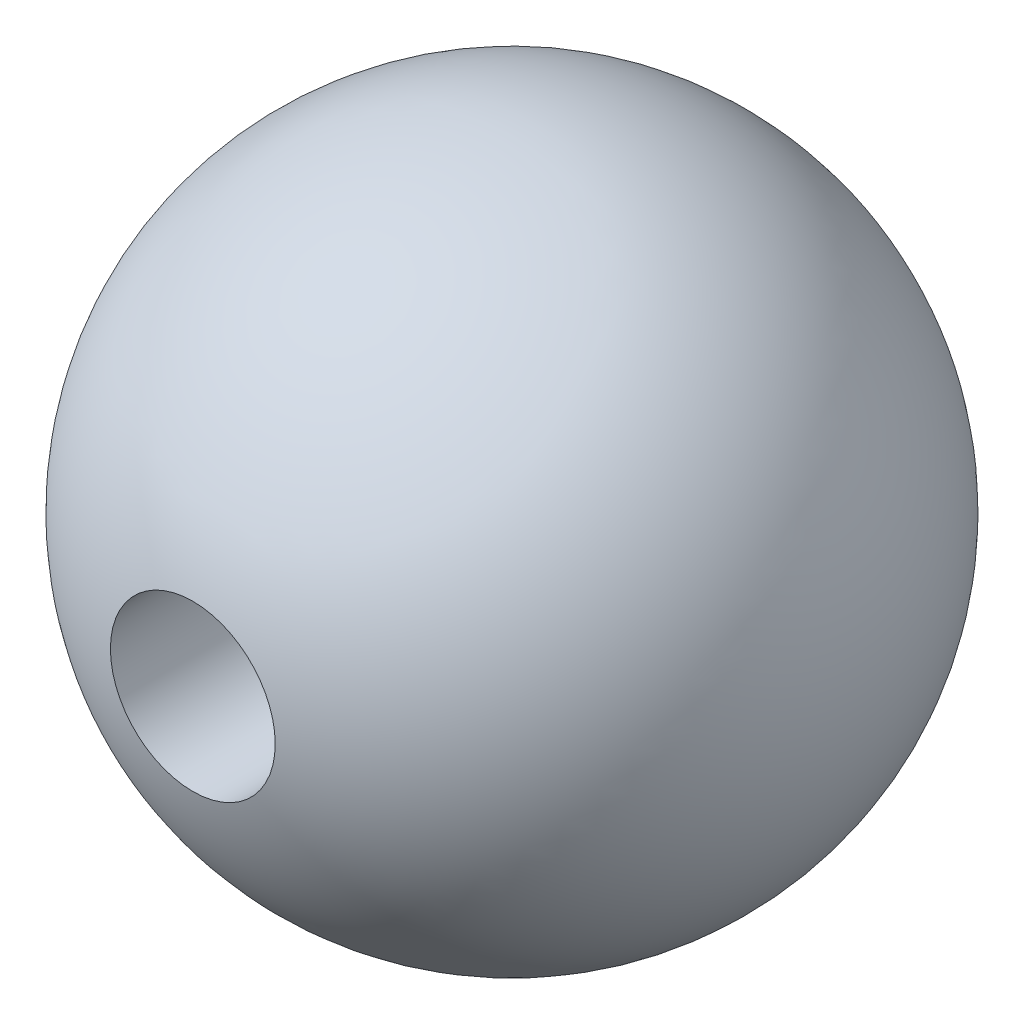
ISO-10303-21;
HEADER;
FILE_DESCRIPTION(('STEP AP214'),'2;1');
FILE_NAME('part.step','',(''),(''),'','','');
FILE_SCHEMA(('AUTOMOTIVE_DESIGN { 1 0 10303 214 1 1 1 1 }'));
ENDSEC;
DATA;
#1=APPLICATION_CONTEXT('core data for automotive mechanical design processes');
#2=APPLICATION_PROTOCOL_DEFINITION('international standard','automotive_design',2000,#1);
#3=PRODUCT_CONTEXT('',#1,'mechanical');
#4=PRODUCT('Part','Part','',(#3));
#5=PRODUCT_RELATED_PRODUCT_CATEGORY('part','',(#4));
#6=PRODUCT_DEFINITION_FORMATION('','',#4);
#7=PRODUCT_DEFINITION_CONTEXT('part definition',#1,'design');
#8=PRODUCT_DEFINITION('design','',#6,#7);
#9=PRODUCT_DEFINITION_SHAPE('','',#8);
#10=(LENGTH_UNIT() NAMED_UNIT(*) SI_UNIT(.MILLI.,.METRE.));
#11=(NAMED_UNIT(*) PLANE_ANGLE_UNIT() SI_UNIT($,.RADIAN.));
#12=(NAMED_UNIT(*) SI_UNIT($,.STERADIAN.) SOLID_ANGLE_UNIT());
#13=UNCERTAINTY_MEASURE_WITH_UNIT(LENGTH_MEASURE(1.E-05),#10,'distance_accuracy_value','');
#14=(GEOMETRIC_REPRESENTATION_CONTEXT(3) GLOBAL_UNCERTAINTY_ASSIGNED_CONTEXT((#13)) GLOBAL_UNIT_ASSIGNED_CONTEXT((#10,
#11,#12)) REPRESENTATION_CONTEXT('',''));
#15=CARTESIAN_POINT('',(0.,0.,0.));
#16=DIRECTION('',(0.,0.,1.));
#17=DIRECTION('',(1.,0.,0.));
#18=AXIS2_PLACEMENT_3D('',#15,#16,#17);
#19=CARTESIAN_POINT('',(0.,0.,0.201638937895726));
#20=DIRECTION('',(0.,0.,-1.));
#21=DIRECTION('',(0.,-1.,0.));
#22=AXIS2_PLACEMENT_3D('',#19,#20,#21);
#23=SPHERICAL_SURFACE('',#22,12.7);
#24=CARTESIAN_POINT('',(0.,0.,12.4983610621043));
#25=DIRECTION('',(0.,0.,-1.));
#26=DIRECTION('',(0.,1.,0.));
#27=AXIS2_PLACEMENT_3D('',#24,#25,#26);
#28=CIRCLE('',#27,3.175);
#29=CARTESIAN_POINT('',(0.,3.175,12.4983610621043));
#30=VERTEX_POINT('',#29);
#31=EDGE_CURVE('E44',#30,#30,#28,.T.);
#32=ORIENTED_EDGE('',*,*,#31,.T.);
#33=EDGE_LOOP('',(#32));
#34=FACE_BOUND('',#33,.T.);
#35=ADVANCED_FACE('F38',(#34),#23,.T.);
#36=CARTESIAN_POINT('',(0.,3.175,-0.201638937895722));
#37=DIRECTION('',(0.,0.,1.));
#38=DIRECTION('',(0.,-1.,0.));
#39=AXIS2_PLACEMENT_3D('',#36,#37,#38);
#40=PLANE('',#39);
#41=CARTESIAN_POINT('',(0.,0.,-0.201638937895722));
#42=DIRECTION('',(0.,0.,-1.));
#43=DIRECTION('',(0.,1.,0.));
#44=AXIS2_PLACEMENT_3D('',#41,#42,#43);
#45=CIRCLE('',#44,3.175);
#46=CARTESIAN_POINT('',(0.,3.175,-0.201638937895721));
#47=VERTEX_POINT('',#46);
#48=EDGE_CURVE('E10',#47,#47,#45,.T.);
#49=ORIENTED_EDGE('',*,*,#48,.F.);
#50=EDGE_LOOP('',(#49));
#51=FACE_BOUND('',#50,.T.);
#52=ADVANCED_FACE('F53',(#51),#40,.T.);
#53=CARTESIAN_POINT('',(0.,0.,-12.4983610621043));
#54=DIRECTION('',(0.,0.,-1.));
#55=DIRECTION('',(0.,1.,0.));
#56=AXIS2_PLACEMENT_3D('',#53,#54,#55);
#57=CYLINDRICAL_SURFACE('',#56,3.175);
#58=ORIENTED_EDGE('',*,*,#48,.T.);
#59=EDGE_LOOP('',(#58));
#60=FACE_BOUND('',#59,.T.);
#61=ORIENTED_EDGE('',*,*,#31,.F.);
#62=EDGE_LOOP('',(#61));
#63=FACE_BOUND('',#62,.T.);
#64=ADVANCED_FACE('F51',(#60,#63),#57,.F.);
#65=CLOSED_SHELL('',(#35,#52,#64));
#66=MANIFOLD_SOLID_BREP('B2',#65);
#67=ADVANCED_BREP_SHAPE_REPRESENTATION('',(#18,#66),#14);
#68=SHAPE_DEFINITION_REPRESENTATION(#9,#67);
ENDSEC;
END-ISO-10303-21;
